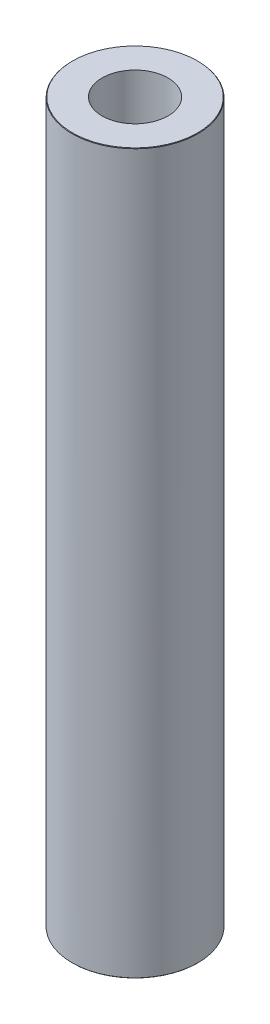
ISO-10303-21;
HEADER;
FILE_DESCRIPTION(('STEP AP214'),'2;1');
FILE_NAME('part.step','',(''),(''),'','','');
FILE_SCHEMA(('AUTOMOTIVE_DESIGN { 1 0 10303 214 1 1 1 1 }'));
ENDSEC;
DATA;
#1=APPLICATION_CONTEXT('core data for automotive mechanical design processes');
#2=APPLICATION_PROTOCOL_DEFINITION('international standard','automotive_design',2000,#1);
#3=PRODUCT_CONTEXT('',#1,'mechanical');
#4=PRODUCT('Part','Part','',(#3));
#5=PRODUCT_RELATED_PRODUCT_CATEGORY('part','',(#4));
#6=PRODUCT_DEFINITION_FORMATION('','',#4);
#7=PRODUCT_DEFINITION_CONTEXT('part definition',#1,'design');
#8=PRODUCT_DEFINITION('design','',#6,#7);
#9=PRODUCT_DEFINITION_SHAPE('','',#8);
#10=(LENGTH_UNIT() NAMED_UNIT(*) SI_UNIT(.MILLI.,.METRE.));
#11=(NAMED_UNIT(*) PLANE_ANGLE_UNIT() SI_UNIT($,.RADIAN.));
#12=(NAMED_UNIT(*) SI_UNIT($,.STERADIAN.) SOLID_ANGLE_UNIT());
#13=UNCERTAINTY_MEASURE_WITH_UNIT(LENGTH_MEASURE(1.E-05),#10,'distance_accuracy_value','');
#14=(GEOMETRIC_REPRESENTATION_CONTEXT(3) GLOBAL_UNCERTAINTY_ASSIGNED_CONTEXT((#13)) GLOBAL_UNIT_ASSIGNED_CONTEXT((#10,
#11,#12)) REPRESENTATION_CONTEXT('',''));
#15=CARTESIAN_POINT('',(0.,0.,0.));
#16=DIRECTION('',(0.,0.,1.));
#17=DIRECTION('',(1.,0.,0.));
#18=AXIS2_PLACEMENT_3D('',#15,#16,#17);
#19=CARTESIAN_POINT('',(0.,600.,0.));
#20=DIRECTION('',(0.,-1.,0.));
#21=DIRECTION('',(0.,0.,-1.));
#22=AXIS2_PLACEMENT_3D('',#19,#20,#21);
#23=CYLINDRICAL_SURFACE('',#22,52.5);
#24=CARTESIAN_POINT('',(0.,599.610245536241,0.));
#25=DIRECTION('',(0.,1.,0.));
#26=DIRECTION('',(0.,0.,1.));
#27=AXIS2_PLACEMENT_3D('',#24,#25,#26);
#28=CIRCLE('',#27,52.5);
#29=CARTESIAN_POINT('',(0.,599.610245536241,-52.5000000000001));
#30=VERTEX_POINT('',#29);
#31=EDGE_CURVE('E50',#30,#30,#28,.F.);
#32=ORIENTED_EDGE('',*,*,#31,.T.);
#33=EDGE_LOOP('',(#32));
#34=FACE_BOUND('',#33,.T.);
#35=CARTESIAN_POINT('',(0.,0.389754463758996,0.));
#36=DIRECTION('',(0.,1.,0.));
#37=DIRECTION('',(0.,0.,1.));
#38=AXIS2_PLACEMENT_3D('',#35,#36,#37);
#39=CIRCLE('',#38,52.5);
#40=CARTESIAN_POINT('',(0.,0.389754463758996,52.5));
#41=VERTEX_POINT('',#40);
#42=EDGE_CURVE('E51',#41,#41,#39,.T.);
#43=ORIENTED_EDGE('',*,*,#42,.T.);
#44=EDGE_LOOP('',(#43));
#45=FACE_BOUND('',#44,.T.);
#46=ADVANCED_FACE('F39',(#34,#45),#23,.T.);
#47=CARTESIAN_POINT('',(0.,600.,0.));
#48=DIRECTION('',(0.,1.,0.));
#49=DIRECTION('',(0.,0.,1.));
#50=AXIS2_PLACEMENT_3D('',#47,#48,#49);
#51=PLANE('',#50);
#52=CARTESIAN_POINT('',(0.,600.,0.));
#53=DIRECTION('',(0.,1.,0.));
#54=DIRECTION('',(0.,0.,1.));
#55=AXIS2_PLACEMENT_3D('',#52,#53,#54);
#56=CIRCLE('',#55,52.1102455362408);
#57=CARTESIAN_POINT('',(0.,600.,-52.1102455362408));
#58=VERTEX_POINT('',#57);
#59=EDGE_CURVE('E54',#58,#58,#56,.T.);
#60=ORIENTED_EDGE('',*,*,#59,.T.);
#61=EDGE_LOOP('',(#60));
#62=FACE_BOUND('',#61,.T.);
#63=CARTESIAN_POINT('',(0.,600.,0.));
#64=DIRECTION('',(0.,1.,0.));
#65=DIRECTION('',(0.,0.,1.));
#66=AXIS2_PLACEMENT_3D('',#63,#64,#65);
#67=CIRCLE('',#66,27.5159113366403);
#68=CARTESIAN_POINT('',(0.,600.,27.5159113366403));
#69=VERTEX_POINT('',#68);
#70=EDGE_CURVE('E58',#69,#69,#67,.T.);
#71=ORIENTED_EDGE('',*,*,#70,.F.);
#72=EDGE_LOOP('',(#71));
#73=FACE_BOUND('',#72,.T.);
#74=ADVANCED_FACE('F69',(#62,#73),#51,.T.);
#75=CARTESIAN_POINT('',(0.,0.,0.));
#76=DIRECTION('',(0.,1.,0.));
#77=DIRECTION('',(0.,0.,1.));
#78=AXIS2_PLACEMENT_3D('',#75,#76,#77);
#79=PLANE('',#78);
#80=CARTESIAN_POINT('',(0.,0.,0.));
#81=DIRECTION('',(0.,1.,0.));
#82=DIRECTION('',(0.,0.,1.));
#83=AXIS2_PLACEMENT_3D('',#80,#81,#82);
#84=CIRCLE('',#83,52.1102455362409);
#85=CARTESIAN_POINT('',(0.,0.,52.1102455362409));
#86=VERTEX_POINT('',#85);
#87=EDGE_CURVE('E10',#86,#86,#84,.F.);
#88=ORIENTED_EDGE('',*,*,#87,.T.);
#89=EDGE_LOOP('',(#88));
#90=FACE_BOUND('',#89,.T.);
#91=CARTESIAN_POINT('',(0.,0.,0.));
#92=DIRECTION('',(0.,1.,0.));
#93=DIRECTION('',(0.,0.,1.));
#94=AXIS2_PLACEMENT_3D('',#91,#92,#93);
#95=CIRCLE('',#94,27.5159113366403);
#96=CARTESIAN_POINT('',(0.,0.,27.5159113366403));
#97=VERTEX_POINT('',#96);
#98=EDGE_CURVE('E63',#97,#97,#95,.T.);
#99=ORIENTED_EDGE('',*,*,#98,.T.);
#100=EDGE_LOOP('',(#99));
#101=FACE_BOUND('',#100,.T.);
#102=ADVANCED_FACE('F75',(#90,#101),#79,.F.);
#103=CARTESIAN_POINT('',(0.,600.,0.));
#104=DIRECTION('',(0.,-1.,0.));
#105=DIRECTION('',(0.,0.,-1.));
#106=AXIS2_PLACEMENT_3D('',#103,#104,#105);
#107=CYLINDRICAL_SURFACE('',#106,27.5159113366403);
#108=ORIENTED_EDGE('',*,*,#70,.T.);
#109=EDGE_LOOP('',(#108));
#110=FACE_BOUND('',#109,.T.);
#111=ORIENTED_EDGE('',*,*,#98,.F.);
#112=EDGE_LOOP('',(#111));
#113=FACE_BOUND('',#112,.T.);
#114=ADVANCED_FACE('F70',(#110,#113),#107,.F.);
#115=CARTESIAN_POINT('',(0.,600.,0.));
#116=DIRECTION('',(0.,-1.,0.));
#117=DIRECTION('',(0.,0.,-1.));
#118=AXIS2_PLACEMENT_3D('',#115,#116,#117);
#119=CONICAL_SURFACE('',#118,52.1102455362408,0.785398163397448);
#120=CARTESIAN_POINT('',(0.,599.610245536241,-52.5000000000001));
#121=CARTESIAN_POINT('',(0.,599.614305478572,-52.4959400576692));
#122=CARTESIAN_POINT('',(0.,599.618365420902,-52.4918801153384));
#123=CARTESIAN_POINT('',(0.,599.626485305564,-52.4837602306768));
#124=CARTESIAN_POINT('',(0.,599.630545247895,-52.4797002883459));
#125=CARTESIAN_POINT('',(0.,599.638665132557,-52.4715804036843));
#126=CARTESIAN_POINT('',(0.,599.642725074887,-52.4675204613534));
#127=CARTESIAN_POINT('',(0.,599.650844959549,-52.4594005766918));
#128=CARTESIAN_POINT('',(0.,599.65490490188,-52.455340634361));
#129=CARTESIAN_POINT('',(0.,599.663024786541,-52.4472207496993));
#130=CARTESIAN_POINT('',(0.,599.667084728872,-52.4431608073685));
#131=CARTESIAN_POINT('',(0.,599.675204613534,-52.4350409227068));
#132=CARTESIAN_POINT('',(0.,599.679264555865,-52.430980980376));
#133=CARTESIAN_POINT('',(0.,599.687384440526,-52.4228610957144));
#134=CARTESIAN_POINT('',(0.,599.691444382857,-52.4188011533835));
#135=CARTESIAN_POINT('',(0.,599.699564267519,-52.4106812687219));
#136=CARTESIAN_POINT('',(0.,599.70362420985,-52.4066213263911));
#137=CARTESIAN_POINT('',(0.,599.711744094511,-52.3985014417294));
#138=CARTESIAN_POINT('',(0.,599.715804036842,-52.3944414993986));
#139=CARTESIAN_POINT('',(0.,599.723923921504,-52.3863216147369));
#140=CARTESIAN_POINT('',(0.,599.727983863835,-52.3822616724061));
#141=CARTESIAN_POINT('',(0.,599.736103748496,-52.3741417877445));
#142=CARTESIAN_POINT('',(0.,599.740163690827,-52.3700818454136));
#143=CARTESIAN_POINT('',(0.,599.748283575489,-52.361961960752));
#144=CARTESIAN_POINT('',(0.,599.75234351782,-52.3579020184212));
#145=CARTESIAN_POINT('',(0.,599.760463402481,-52.3497821337595));
#146=CARTESIAN_POINT('',(0.,599.764523344812,-52.3457221914287));
#147=CARTESIAN_POINT('',(0.,599.772643229474,-52.337602306767));
#148=CARTESIAN_POINT('',(0.,599.776703171805,-52.3335423644362));
#149=CARTESIAN_POINT('',(0.,599.784823056466,-52.3254224797746));
#150=CARTESIAN_POINT('',(0.,599.788882998797,-52.3213625374437));
#151=CARTESIAN_POINT('',(0.,599.797002883459,-52.3132426527821));
#152=CARTESIAN_POINT('',(0.,599.801062825789,-52.3091827104513));
#153=CARTESIAN_POINT('',(0.,599.809182710451,-52.3010628257896));
#154=CARTESIAN_POINT('',(0.,599.813242652782,-52.2970028834588));
#155=CARTESIAN_POINT('',(0.,599.821362537444,-52.2888829987971));
#156=CARTESIAN_POINT('',(0.,599.825422479774,-52.2848230564663));
#157=CARTESIAN_POINT('',(0.,599.833542364436,-52.2767031718047));
#158=CARTESIAN_POINT('',(0.,599.837602306767,-52.2726432294738));
#159=CARTESIAN_POINT('',(0.,599.845722191429,-52.2645233448122));
#160=CARTESIAN_POINT('',(0.,599.849782133759,-52.2604634024814));
#161=CARTESIAN_POINT('',(0.,599.857902018421,-52.2523435178197));
#162=CARTESIAN_POINT('',(0.,599.861961960752,-52.2482835754889));
#163=CARTESIAN_POINT('',(0.,599.870081845414,-52.2401636908272));
#164=CARTESIAN_POINT('',(0.,599.874141787744,-52.2361037484964));
#165=CARTESIAN_POINT('',(0.,599.882261672406,-52.2279838638348));
#166=CARTESIAN_POINT('',(0.,599.886321614737,-52.2239239215039));
#167=CARTESIAN_POINT('',(0.,599.894441499399,-52.2158040368423));
#168=CARTESIAN_POINT('',(0.,599.898501441729,-52.2117440945115));
#169=CARTESIAN_POINT('',(0.,599.906621326391,-52.2036242098498));
#170=CARTESIAN_POINT('',(0.,599.910681268722,-52.199564267519));
#171=CARTESIAN_POINT('',(0.,599.918801153383,-52.1914443828573));
#172=CARTESIAN_POINT('',(0.,599.922861095714,-52.1873844405265));
#173=CARTESIAN_POINT('',(0.,599.930980980376,-52.1792645558649));
#174=CARTESIAN_POINT('',(0.,599.935040922707,-52.175204613534));
#175=CARTESIAN_POINT('',(0.,599.943160807368,-52.1670847288724));
#176=CARTESIAN_POINT('',(0.,599.947220749699,-52.1630247865416));
#177=CARTESIAN_POINT('',(0.,599.955340634361,-52.1549049018799));
#178=CARTESIAN_POINT('',(0.,599.959400576692,-52.1508449595491));
#179=CARTESIAN_POINT('',(0.,599.967520461353,-52.1427250748874));
#180=CARTESIAN_POINT('',(0.,599.971580403684,-52.1386651325566));
#181=CARTESIAN_POINT('',(0.,599.979700288346,-52.130545247895));
#182=CARTESIAN_POINT('',(0.,599.983760230677,-52.1264853055641));
#183=CARTESIAN_POINT('',(0.,599.991880115338,-52.1183654209025));
#184=CARTESIAN_POINT('',(0.,599.995940057669,-52.1143054785716));
#185=CARTESIAN_POINT('',(0.,600.,-52.1102455362408));
#186=B_SPLINE_CURVE_WITH_KNOTS('',3,(#120,#121,#122,#123,#124,#125,#126,#127,#128,#129,#130,
#131,#132,#133,#134,#135,#136,#137,#138,#139,#140,#141,#142,#143,#144,#145,#146,#147,#148,#149,
#150,#151,#152,#153,#154,#155,#156,#157,#158,#159,#160,#161,#162,#163,#164,#165,#166,#167,#168,
#169,#170,#171,#172,#173,#174,#175,#176,#177,#178,#179,#180,#181,#182,#183,#184,#185),
.UNSPECIFIED.,.F.,.F.,(4,2,2,2,2,2,2,2,2,2,2,2,2,2,2,2,2,2,2,2,2,2,2,2,2,2,2,2,2,2,2,2,4),(0.,
0.0172248765200776,0.0344497530402337,0.0516746295603112,0.0688995060804673,0.0861243826005449,
0.103349259120701,0.120574135640779,0.137799012160935,0.155023888681012,0.172248765201168,
0.189473641721246,0.206698518241402,0.22392339476148,0.241148271281636,0.258373147801713,
0.275598024321869,0.292822900841947,0.310047777362103,0.327272653882181,0.344497530402337,
0.361722406922414,0.37894728344257,0.396172159962648,0.413397036482804,0.430621913002882,
0.447846789523038,0.465071666043115,0.482296542563271,0.499521419083349,0.516746295603505,
0.533971172123582,0.551196048643739),.UNSPECIFIED.);
#187=EDGE_CURVE('BSEAM81',#30,#58,#186,.T.);
#188=ORIENTED_EDGE('',*,*,#31,.F.);
#189=ORIENTED_EDGE('',*,*,#59,.F.);
#190=ORIENTED_EDGE('',*,*,#187,.T.);
#191=ORIENTED_EDGE('',*,*,#187,.F.);
#192=EDGE_LOOP('',(#188,#190,#189,#191));
#193=FACE_BOUND('',#192,.T.);
#194=ADVANCED_FACE('F81',(#193),#119,.T.);
#195=CARTESIAN_POINT('',(0.,0.389754463758996,0.));
#196=DIRECTION('',(0.,1.,0.));
#197=DIRECTION('',(0.,0.,1.));
#198=AXIS2_PLACEMENT_3D('',#195,#196,#197);
#199=CONICAL_SURFACE('',#198,52.5,0.785398163397528);
#200=ORIENTED_EDGE('',*,*,#87,.F.);
#201=EDGE_LOOP('',(#200));
#202=FACE_BOUND('',#201,.T.);
#203=ORIENTED_EDGE('',*,*,#42,.F.);
#204=EDGE_LOOP('',(#203));
#205=FACE_BOUND('',#204,.T.);
#206=ADVANCED_FACE('F45',(#202,#205),#199,.T.);
#207=CLOSED_SHELL('',(#46,#74,#102,#114,#194,#206));
#208=MANIFOLD_SOLID_BREP('B2',#207);
#209=ADVANCED_BREP_SHAPE_REPRESENTATION('',(#18,#208),#14);
#210=SHAPE_DEFINITION_REPRESENTATION(#9,#209);
ENDSEC;
END-ISO-10303-21;
